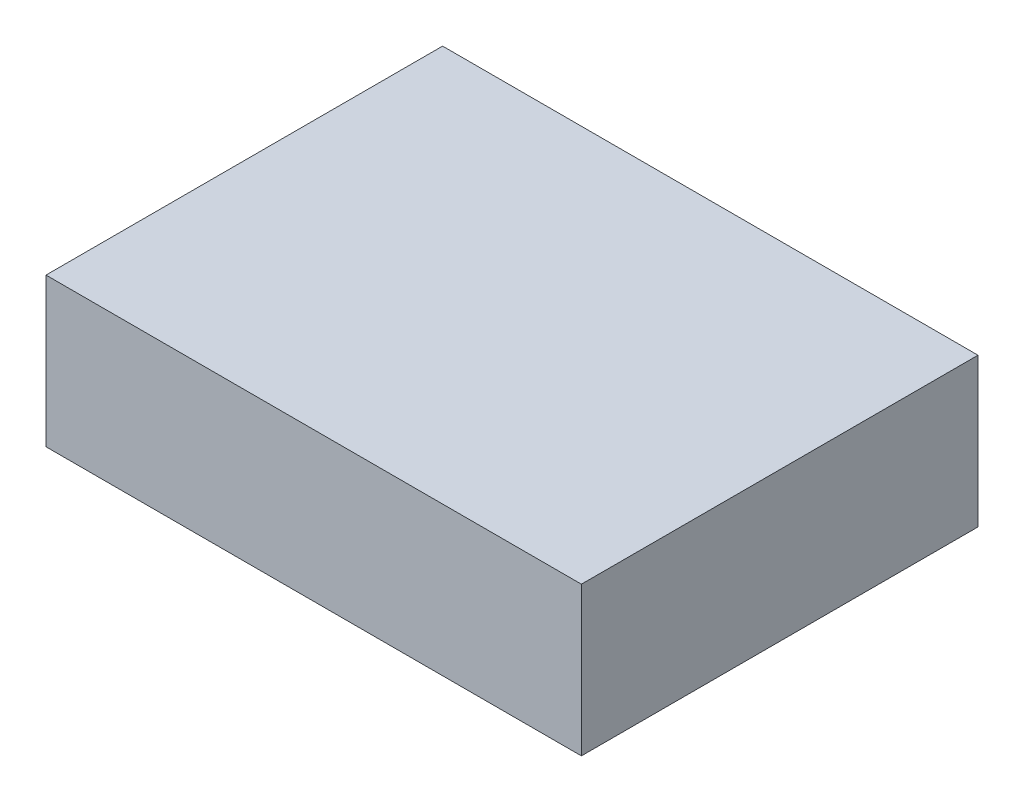
ISO-10303-21;
HEADER;
FILE_DESCRIPTION(('STEP AP214'),'2;1');
FILE_NAME('part.step','',(''),(''),'','','');
FILE_SCHEMA(('AUTOMOTIVE_DESIGN { 1 0 10303 214 1 1 1 1 }'));
ENDSEC;
DATA;
#1=APPLICATION_CONTEXT('core data for automotive mechanical design processes');
#2=APPLICATION_PROTOCOL_DEFINITION('international standard','automotive_design',2000,#1);
#3=PRODUCT_CONTEXT('',#1,'mechanical');
#4=PRODUCT('Part','Part','',(#3));
#5=PRODUCT_RELATED_PRODUCT_CATEGORY('part','',(#4));
#6=PRODUCT_DEFINITION_FORMATION('','',#4);
#7=PRODUCT_DEFINITION_CONTEXT('part definition',#1,'design');
#8=PRODUCT_DEFINITION('design','',#6,#7);
#9=PRODUCT_DEFINITION_SHAPE('','',#8);
#10=(LENGTH_UNIT() NAMED_UNIT(*) SI_UNIT(.MILLI.,.METRE.));
#11=(NAMED_UNIT(*) PLANE_ANGLE_UNIT() SI_UNIT($,.RADIAN.));
#12=(NAMED_UNIT(*) SI_UNIT($,.STERADIAN.) SOLID_ANGLE_UNIT());
#13=UNCERTAINTY_MEASURE_WITH_UNIT(LENGTH_MEASURE(1.E-05),#10,'distance_accuracy_value','');
#14=(GEOMETRIC_REPRESENTATION_CONTEXT(3) GLOBAL_UNCERTAINTY_ASSIGNED_CONTEXT((#13)) GLOBAL_UNIT_ASSIGNED_CONTEXT((#10,
#11,#12)) REPRESENTATION_CONTEXT('',''));
#15=CARTESIAN_POINT('',(0.,0.,0.));
#16=DIRECTION('',(0.,0.,1.));
#17=DIRECTION('',(1.,0.,0.));
#18=AXIS2_PLACEMENT_3D('',#15,#16,#17);
#19=CARTESIAN_POINT('',(-1.34999984,0.37500052,0.));
#20=DIRECTION('',(0.,1.,0.));
#21=DIRECTION('',(0.,0.,1.));
#22=AXIS2_PLACEMENT_3D('',#19,#20,#21);
#23=PLANE('',#22);
#24=DIRECTION('',(0.,0.,-1.));
#25=VECTOR('',#24,1.);
#26=CARTESIAN_POINT('',(1.34999984,0.37500052,0.));
#27=LINE('',#26,#25);
#28=CARTESIAN_POINT('',(1.34999984,0.37500052,0.));
#29=VERTEX_POINT('',#28);
#30=CARTESIAN_POINT('',(1.34999984,0.37500052,2.00000108));
#31=VERTEX_POINT('',#30);
#32=EDGE_CURVE('E20',#29,#31,#27,.F.);
#33=ORIENTED_EDGE('',*,*,#32,.F.);
#34=DIRECTION('',(1.,0.,0.));
#35=VECTOR('',#34,1.);
#36=CARTESIAN_POINT('',(1.34999984,0.37500052,0.));
#37=LINE('',#36,#35);
#38=CARTESIAN_POINT('',(-1.34999984,0.37500052,0.));
#39=VERTEX_POINT('',#38);
#40=EDGE_CURVE('E80',#29,#39,#37,.F.);
#41=ORIENTED_EDGE('',*,*,#40,.T.);
#42=DIRECTION('',(0.,0.,1.));
#43=VECTOR('',#42,1.);
#44=CARTESIAN_POINT('',(-1.34999984,0.37500052,0.));
#45=LINE('',#44,#43);
#46=CARTESIAN_POINT('',(-1.34999984,0.37500052,2.00000108));
#47=VERTEX_POINT('',#46);
#48=EDGE_CURVE('E68',#47,#39,#45,.F.);
#49=ORIENTED_EDGE('',*,*,#48,.F.);
#50=DIRECTION('',(1.,0.,0.));
#51=VECTOR('',#50,1.);
#52=CARTESIAN_POINT('',(1.34999984,0.37500052,2.00000108));
#53=LINE('',#52,#51);
#54=EDGE_CURVE('E56',#31,#47,#53,.F.);
#55=ORIENTED_EDGE('',*,*,#54,.F.);
#56=EDGE_LOOP('',(#33,#41,#49,#55));
#57=FACE_BOUND('',#56,.T.);
#58=ADVANCED_FACE('F17',(#57),#23,.T.);
#59=CARTESIAN_POINT('',(1.34999984,0.37500052,0.));
#60=DIRECTION('',(1.,0.,0.));
#61=DIRECTION('',(0.,0.,-1.));
#62=AXIS2_PLACEMENT_3D('',#59,#60,#61);
#63=PLANE('',#62);
#64=DIRECTION('',(0.,0.,-1.));
#65=VECTOR('',#64,1.);
#66=CARTESIAN_POINT('',(1.34999984,-0.37500052,0.));
#67=LINE('',#66,#65);
#68=CARTESIAN_POINT('',(1.34999984,-0.37500052,0.));
#69=VERTEX_POINT('',#68);
#70=CARTESIAN_POINT('',(1.34999984,-0.37500052,2.00000108));
#71=VERTEX_POINT('',#70);
#72=EDGE_CURVE('E83',#69,#71,#67,.F.);
#73=ORIENTED_EDGE('',*,*,#72,.F.);
#74=DIRECTION('',(0.,1.,0.));
#75=VECTOR('',#74,1.);
#76=CARTESIAN_POINT('',(1.34999984,-0.37500052,0.));
#77=LINE('',#76,#75);
#78=EDGE_CURVE('E65',#69,#29,#77,.T.);
#79=ORIENTED_EDGE('',*,*,#78,.T.);
#80=ORIENTED_EDGE('',*,*,#32,.T.);
#81=DIRECTION('',(0.,1.,0.));
#82=VECTOR('',#81,1.);
#83=CARTESIAN_POINT('',(1.34999984,-0.37500052,2.00000108));
#84=LINE('',#83,#82);
#85=EDGE_CURVE('E62',#71,#31,#84,.T.);
#86=ORIENTED_EDGE('',*,*,#85,.F.);
#87=EDGE_LOOP('',(#73,#79,#80,#86));
#88=FACE_BOUND('',#87,.T.);
#89=ADVANCED_FACE('F61',(#88),#63,.T.);
#90=CARTESIAN_POINT('',(1.34999984,-0.37500052,2.00000108));
#91=DIRECTION('',(0.,0.,1.));
#92=DIRECTION('',(1.,0.,0.));
#93=AXIS2_PLACEMENT_3D('',#90,#91,#92);
#94=PLANE('',#93);
#95=DIRECTION('',(0.,1.,0.));
#96=VECTOR('',#95,1.);
#97=CARTESIAN_POINT('',(-1.34999984,-0.37500052,2.00000108));
#98=LINE('',#97,#96);
#99=CARTESIAN_POINT('',(-1.34999984,-0.37500052,2.00000108));
#100=VERTEX_POINT('',#99);
#101=EDGE_CURVE('E70',#100,#47,#98,.T.);
#102=ORIENTED_EDGE('',*,*,#101,.F.);
#103=DIRECTION('',(1.,0.,0.));
#104=VECTOR('',#103,1.);
#105=CARTESIAN_POINT('',(1.34999984,-0.37500052,2.00000108));
#106=LINE('',#105,#104);
#107=EDGE_CURVE('E74',#71,#100,#106,.F.);
#108=ORIENTED_EDGE('',*,*,#107,.F.);
#109=ORIENTED_EDGE('',*,*,#85,.T.);
#110=ORIENTED_EDGE('',*,*,#54,.T.);
#111=EDGE_LOOP('',(#102,#108,#109,#110));
#112=FACE_BOUND('',#111,.T.);
#113=ADVANCED_FACE('F72',(#112),#94,.T.);
#114=CARTESIAN_POINT('',(-1.34999984,-0.37500052,0.));
#115=DIRECTION('',(-1.,0.,0.));
#116=DIRECTION('',(0.,0.,1.));
#117=AXIS2_PLACEMENT_3D('',#114,#115,#116);
#118=PLANE('',#117);
#119=ORIENTED_EDGE('',*,*,#48,.T.);
#120=DIRECTION('',(0.,1.,0.));
#121=VECTOR('',#120,1.);
#122=CARTESIAN_POINT('',(-1.34999984,-0.37500052,0.));
#123=LINE('',#122,#121);
#124=CARTESIAN_POINT('',(-1.34999984,-0.37500052,0.));
#125=VERTEX_POINT('',#124);
#126=EDGE_CURVE('E35',#39,#125,#123,.F.);
#127=ORIENTED_EDGE('',*,*,#126,.T.);
#128=DIRECTION('',(0.,0.,-1.));
#129=VECTOR('',#128,1.);
#130=CARTESIAN_POINT('',(-1.34999984,-0.37500052,0.));
#131=LINE('',#130,#129);
#132=EDGE_CURVE('E26',#100,#125,#131,.T.);
#133=ORIENTED_EDGE('',*,*,#132,.F.);
#134=ORIENTED_EDGE('',*,*,#101,.T.);
#135=EDGE_LOOP('',(#119,#127,#133,#134));
#136=FACE_BOUND('',#135,.T.);
#137=ADVANCED_FACE('F89',(#136),#118,.T.);
#138=CARTESIAN_POINT('',(1.34999984,-0.37500052,0.));
#139=DIRECTION('',(0.,0.,1.));
#140=DIRECTION('',(1.,0.,0.));
#141=AXIS2_PLACEMENT_3D('',#138,#139,#140);
#142=PLANE('',#141);
#143=ORIENTED_EDGE('',*,*,#126,.F.);
#144=ORIENTED_EDGE('',*,*,#40,.F.);
#145=ORIENTED_EDGE('',*,*,#78,.F.);
#146=DIRECTION('',(1.,0.,0.));
#147=VECTOR('',#146,1.);
#148=CARTESIAN_POINT('',(1.34999984,-0.37500052,0.));
#149=LINE('',#148,#147);
#150=EDGE_CURVE('E11',#125,#69,#149,.T.);
#151=ORIENTED_EDGE('',*,*,#150,.F.);
#152=EDGE_LOOP('',(#143,#144,#145,#151));
#153=FACE_BOUND('',#152,.T.);
#154=ADVANCED_FACE('F91',(#153),#142,.F.);
#155=CARTESIAN_POINT('',(1.34999984,-0.37500052,0.));
#156=DIRECTION('',(0.,-1.,0.));
#157=DIRECTION('',(0.,0.,-1.));
#158=AXIS2_PLACEMENT_3D('',#155,#156,#157);
#159=PLANE('',#158);
#160=ORIENTED_EDGE('',*,*,#132,.T.);
#161=ORIENTED_EDGE('',*,*,#150,.T.);
#162=ORIENTED_EDGE('',*,*,#72,.T.);
#163=ORIENTED_EDGE('',*,*,#107,.T.);
#164=EDGE_LOOP('',(#160,#161,#162,#163));
#165=FACE_BOUND('',#164,.T.);
#166=ADVANCED_FACE('F88',(#165),#159,.T.);
#167=CLOSED_SHELL('',(#58,#89,#113,#137,#154,#166));
#168=MANIFOLD_SOLID_BREP('B1',#167);
#169=ADVANCED_BREP_SHAPE_REPRESENTATION('',(#18,#168),#14);
#170=SHAPE_DEFINITION_REPRESENTATION(#9,#169);
ENDSEC;
END-ISO-10303-21;
